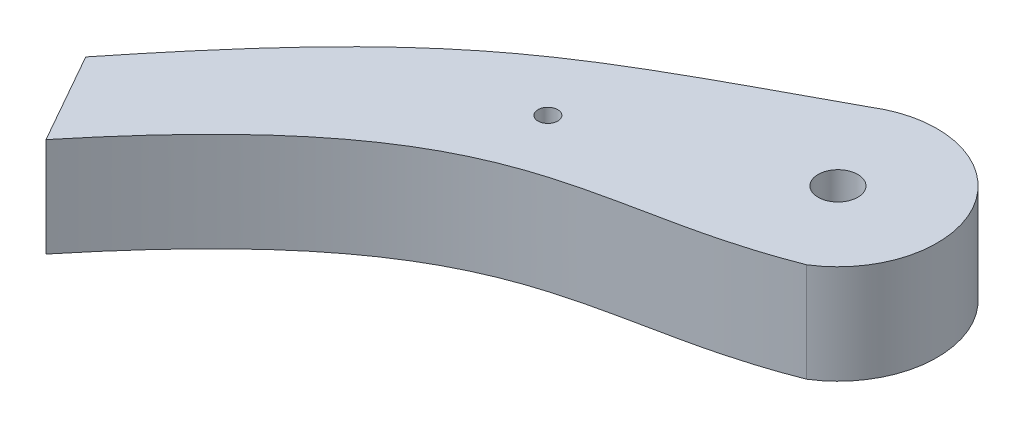
ISO-10303-21;
HEADER;
FILE_DESCRIPTION(('STEP AP214'),'2;1');
FILE_NAME('part.step','',(''),(''),'','','');
FILE_SCHEMA(('AUTOMOTIVE_DESIGN { 1 0 10303 214 1 1 1 1 }'));
ENDSEC;
DATA;
#1=APPLICATION_CONTEXT('core data for automotive mechanical design processes');
#2=APPLICATION_PROTOCOL_DEFINITION('international standard','automotive_design',2000,#1);
#3=PRODUCT_CONTEXT('',#1,'mechanical');
#4=PRODUCT('Part','Part','',(#3));
#5=PRODUCT_RELATED_PRODUCT_CATEGORY('part','',(#4));
#6=PRODUCT_DEFINITION_FORMATION('','',#4);
#7=PRODUCT_DEFINITION_CONTEXT('part definition',#1,'design');
#8=PRODUCT_DEFINITION('design','',#6,#7);
#9=PRODUCT_DEFINITION_SHAPE('','',#8);
#10=(LENGTH_UNIT() NAMED_UNIT(*) SI_UNIT(.MILLI.,.METRE.));
#11=(NAMED_UNIT(*) PLANE_ANGLE_UNIT() SI_UNIT($,.RADIAN.));
#12=(NAMED_UNIT(*) SI_UNIT($,.STERADIAN.) SOLID_ANGLE_UNIT());
#13=UNCERTAINTY_MEASURE_WITH_UNIT(LENGTH_MEASURE(1.E-05),#10,'distance_accuracy_value','');
#14=(GEOMETRIC_REPRESENTATION_CONTEXT(3) GLOBAL_UNCERTAINTY_ASSIGNED_CONTEXT((#13)) GLOBAL_UNIT_ASSIGNED_CONTEXT((#10,
#11,#12)) REPRESENTATION_CONTEXT('',''));
#15=CARTESIAN_POINT('',(0.,0.,0.));
#16=DIRECTION('',(0.,0.,1.));
#17=DIRECTION('',(1.,0.,0.));
#18=AXIS2_PLACEMENT_3D('',#15,#16,#17);
#19=CARTESIAN_POINT('',(-17.529895554147,10.,14.5542905389386));
#20=DIRECTION('',(0.,1.,0.));
#21=DIRECTION('',(0.,0.,1.));
#22=AXIS2_PLACEMENT_3D('',#19,#20,#21);
#23=PLANE('',#22);
#24=CARTESIAN_POINT('',(0.,10.,0.));
#25=DIRECTION('',(0.,1.,0.));
#26=DIRECTION('',(0.,0.,1.));
#27=AXIS2_PLACEMENT_3D('',#24,#25,#26);
#28=CIRCLE('',#27,2.);
#29=CARTESIAN_POINT('',(0.,10.,2.));
#30=VERTEX_POINT('',#29);
#31=EDGE_CURVE('E144',#30,#30,#28,.T.);
#32=ORIENTED_EDGE('',*,*,#31,.F.);
#33=EDGE_LOOP('',(#32));
#34=FACE_BOUND('',#33,.T.);
#35=CARTESIAN_POINT('',(-43.9806813876151,10.,35.9000711908986));
#36=CARTESIAN_POINT('',(-21.8125512290961,10.,8.74021580460605));
#37=CARTESIAN_POINT('',(-12.0456104712389,10.,15.2812172083559));
#38=CARTESIAN_POINT('',(5.31600205544364,10.,8.46995408172435));
#39=B_SPLINE_CURVE_WITH_KNOTS('',3,(#35,#36,#37,#38),.UNSPECIFIED.,.F.,.F.,(4,4),(0.,1.),.UNSPECIFIED.);
#40=CARTESIAN_POINT('',(-43.9806813876151,10.,35.9000711908986));
#41=VERTEX_POINT('',#40);
#42=CARTESIAN_POINT('',(5.31600205544364,10.,8.46995408172435));
#43=VERTEX_POINT('',#42);
#44=EDGE_CURVE('E86',#41,#43,#39,.T.);
#45=ORIENTED_EDGE('',*,*,#44,.T.);
#46=CARTESIAN_POINT('',(0.,10.,0.));
#47=DIRECTION('',(0.,1.,0.));
#48=DIRECTION('',(0.,0.,1.));
#49=AXIS2_PLACEMENT_3D('',#46,#47,#48);
#50=CIRCLE('',#49,10.);
#51=CARTESIAN_POINT('',(-5.31600205544364,10.,-8.46995408172435));
#52=VERTEX_POINT('',#51);
#53=EDGE_CURVE('E81',#43,#52,#50,.T.);
#54=ORIENTED_EDGE('',*,*,#53,.T.);
#55=CARTESIAN_POINT('',(-5.31600205544356,10.,-8.46995408172439));
#56=CARTESIAN_POINT('',(-24.9666647630697,10.,2.13955382037074));
#57=CARTESIAN_POINT('',(-31.8452813342878,10.,4.90051761286262));
#58=CARTESIAN_POINT('',(-49.1990291436304,10.,26.6735927837232));
#59=B_SPLINE_CURVE_WITH_KNOTS('',3,(#55,#56,#57,#58),.UNSPECIFIED.,.F.,.F.,(4,4),(0.,1.),.UNSPECIFIED.);
#60=CARTESIAN_POINT('',(-49.1990291436304,10.,26.6735927837232));
#61=VERTEX_POINT('',#60);
#62=EDGE_CURVE('E84',#52,#61,#59,.T.);
#63=ORIENTED_EDGE('',*,*,#62,.T.);
#64=DIRECTION('',(0.492299023748937,0.,0.870426143458389));
#65=VECTOR('',#64,1.);
#66=CARTESIAN_POINT('',(-43.9806813876151,10.,35.9000711908986));
#67=LINE('',#66,#65);
#68=EDGE_CURVE('E51',#61,#41,#67,.T.);
#69=ORIENTED_EDGE('',*,*,#68,.T.);
#70=EDGE_LOOP('',(#45,#54,#63,#69));
#71=FACE_BOUND('',#70,.T.);
#72=CARTESIAN_POINT('',(-20.7887445373771,10.,8.46995408172435));
#73=DIRECTION('',(0.,1.,0.));
#74=DIRECTION('',(0.,0.,1.));
#75=AXIS2_PLACEMENT_3D('',#72,#73,#74);
#76=CIRCLE('',#75,1.);
#77=CARTESIAN_POINT('',(-20.7887445373771,10.,9.46995408172435));
#78=VERTEX_POINT('',#77);
#79=EDGE_CURVE('E135',#78,#78,#76,.T.);
#80=ORIENTED_EDGE('',*,*,#79,.F.);
#81=EDGE_LOOP('',(#80));
#82=FACE_BOUND('',#81,.T.);
#83=ADVANCED_FACE('F33',(#34,#71,#82),#23,.T.);
#84=CARTESIAN_POINT('',(-17.529895554147,0.,14.5542905389386));
#85=DIRECTION('',(0.,1.,0.));
#86=DIRECTION('',(0.,0.,1.));
#87=AXIS2_PLACEMENT_3D('',#84,#85,#86);
#88=PLANE('',#87);
#89=CARTESIAN_POINT('',(0.,0.,0.));
#90=DIRECTION('',(0.,1.,0.));
#91=DIRECTION('',(0.,0.,1.));
#92=AXIS2_PLACEMENT_3D('',#89,#90,#91);
#93=CIRCLE('',#92,2.);
#94=CARTESIAN_POINT('',(0.,0.,2.));
#95=VERTEX_POINT('',#94);
#96=EDGE_CURVE('E141',#95,#95,#93,.T.);
#97=ORIENTED_EDGE('',*,*,#96,.T.);
#98=EDGE_LOOP('',(#97));
#99=FACE_BOUND('',#98,.T.);
#100=CARTESIAN_POINT('',(-43.9806813876151,0.,35.9000711908986));
#101=CARTESIAN_POINT('',(-21.8125512290961,0.,8.74021580460605));
#102=CARTESIAN_POINT('',(-12.0456104712389,0.,15.2812172083559));
#103=CARTESIAN_POINT('',(5.31600205544364,0.,8.46995408172435));
#104=B_SPLINE_CURVE_WITH_KNOTS('',3,(#100,#101,#102,#103),.UNSPECIFIED.,.F.,.F.,(4,4),(0.,1.),.UNSPECIFIED.);
#105=CARTESIAN_POINT('',(-43.9806813876151,0.,35.9000711908986));
#106=VERTEX_POINT('',#105);
#107=CARTESIAN_POINT('',(5.31600205544364,0.,8.46995408172435));
#108=VERTEX_POINT('',#107);
#109=EDGE_CURVE('E147',#106,#108,#104,.T.);
#110=ORIENTED_EDGE('',*,*,#109,.F.);
#111=DIRECTION('',(0.492299023748937,0.,0.870426143458389));
#112=VECTOR('',#111,1.);
#113=CARTESIAN_POINT('',(-43.9806813876151,0.,35.9000711908986));
#114=LINE('',#113,#112);
#115=CARTESIAN_POINT('',(-49.1990291436304,0.,26.6735927837232));
#116=VERTEX_POINT('',#115);
#117=EDGE_CURVE('E74',#116,#106,#114,.T.);
#118=ORIENTED_EDGE('',*,*,#117,.F.);
#119=CARTESIAN_POINT('',(-5.31600205544356,0.,-8.46995408172439));
#120=CARTESIAN_POINT('',(-24.9666647630697,0.,2.13955382037074));
#121=CARTESIAN_POINT('',(-31.8452813342878,0.,4.90051761286262));
#122=CARTESIAN_POINT('',(-49.1990291436304,0.,26.6735927837232));
#123=B_SPLINE_CURVE_WITH_KNOTS('',3,(#119,#120,#121,#122),.UNSPECIFIED.,.F.,.F.,(4,4),(0.,1.),.UNSPECIFIED.);
#124=CARTESIAN_POINT('',(-5.31600205544364,0.,-8.46995408172435));
#125=VERTEX_POINT('',#124);
#126=EDGE_CURVE('E68',#125,#116,#123,.T.);
#127=ORIENTED_EDGE('',*,*,#126,.F.);
#128=CARTESIAN_POINT('',(0.,0.,0.));
#129=DIRECTION('',(0.,1.,0.));
#130=DIRECTION('',(0.,0.,1.));
#131=AXIS2_PLACEMENT_3D('',#128,#129,#130);
#132=CIRCLE('',#131,10.);
#133=EDGE_CURVE('E90',#108,#125,#132,.T.);
#134=ORIENTED_EDGE('',*,*,#133,.F.);
#135=EDGE_LOOP('',(#110,#118,#127,#134));
#136=FACE_BOUND('',#135,.T.);
#137=CARTESIAN_POINT('',(-20.7887445373771,0.,8.46995408172435));
#138=DIRECTION('',(0.,1.,0.));
#139=DIRECTION('',(0.,0.,1.));
#140=AXIS2_PLACEMENT_3D('',#137,#138,#139);
#141=CIRCLE('',#140,1.);
#142=CARTESIAN_POINT('',(-20.7887445373771,0.,9.46995408172435));
#143=VERTEX_POINT('',#142);
#144=EDGE_CURVE('E138',#143,#143,#141,.T.);
#145=ORIENTED_EDGE('',*,*,#144,.T.);
#146=EDGE_LOOP('',(#145));
#147=FACE_BOUND('',#146,.T.);
#148=ADVANCED_FACE('F112',(#99,#136,#147),#88,.F.);
#149=DIRECTION('',(0.,-1.,0.));
#150=VECTOR('',#149,1.);
#151=SURFACE_OF_LINEAR_EXTRUSION('',#39,#150);
#152=ORIENTED_EDGE('',*,*,#109,.T.);
#153=DIRECTION('',(0.,-1.,0.));
#154=VECTOR('',#153,1.);
#155=CARTESIAN_POINT('',(5.31600205544364,10.,8.46995408172435));
#156=LINE('',#155,#154);
#157=EDGE_CURVE('E11',#43,#108,#156,.T.);
#158=ORIENTED_EDGE('',*,*,#157,.F.);
#159=ORIENTED_EDGE('',*,*,#44,.F.);
#160=DIRECTION('',(0.,-1.,0.));
#161=VECTOR('',#160,1.);
#162=CARTESIAN_POINT('',(-43.9806813876151,10.,35.9000711908986));
#163=LINE('',#162,#161);
#164=EDGE_CURVE('E94',#41,#106,#163,.T.);
#165=ORIENTED_EDGE('',*,*,#164,.T.);
#166=EDGE_LOOP('',(#152,#158,#159,#165));
#167=FACE_BOUND('',#166,.T.);
#168=ADVANCED_FACE('F35',(#167),#151,.F.);
#169=CARTESIAN_POINT('',(0.,10.,0.));
#170=DIRECTION('',(0.,-1.,0.));
#171=DIRECTION('',(0.,0.,-1.));
#172=AXIS2_PLACEMENT_3D('',#169,#170,#171);
#173=CYLINDRICAL_SURFACE('',#172,10.);
#174=ORIENTED_EDGE('',*,*,#133,.T.);
#175=DIRECTION('',(0.,-1.,0.));
#176=VECTOR('',#175,1.);
#177=CARTESIAN_POINT('',(-5.31600205544364,10.,-8.46995408172435));
#178=LINE('',#177,#176);
#179=EDGE_CURVE('E43',#52,#125,#178,.T.);
#180=ORIENTED_EDGE('',*,*,#179,.F.);
#181=ORIENTED_EDGE('',*,*,#53,.F.);
#182=ORIENTED_EDGE('',*,*,#157,.T.);
#183=EDGE_LOOP('',(#174,#180,#181,#182));
#184=FACE_BOUND('',#183,.T.);
#185=ADVANCED_FACE('F89',(#184),#173,.T.);
#186=DIRECTION('',(0.,-1.,0.));
#187=VECTOR('',#186,1.);
#188=SURFACE_OF_LINEAR_EXTRUSION('',#59,#187);
#189=ORIENTED_EDGE('',*,*,#126,.T.);
#190=DIRECTION('',(0.,-1.,0.));
#191=VECTOR('',#190,1.);
#192=CARTESIAN_POINT('',(-49.1990291436304,10.,26.6735927837232));
#193=LINE('',#192,#191);
#194=EDGE_CURVE('E91',#61,#116,#193,.T.);
#195=ORIENTED_EDGE('',*,*,#194,.F.);
#196=ORIENTED_EDGE('',*,*,#62,.F.);
#197=ORIENTED_EDGE('',*,*,#179,.T.);
#198=EDGE_LOOP('',(#189,#195,#196,#197));
#199=FACE_BOUND('',#198,.T.);
#200=ADVANCED_FACE('F92',(#199),#188,.F.);
#201=CARTESIAN_POINT('',(-43.9806813876151,10.,35.9000711908986));
#202=DIRECTION('',(0.870426143458389,0.,-0.492299023748937));
#203=DIRECTION('',(-0.492299023748937,0.,-0.870426143458389));
#204=AXIS2_PLACEMENT_3D('',#201,#202,#203);
#205=PLANE('',#204);
#206=ORIENTED_EDGE('',*,*,#117,.T.);
#207=ORIENTED_EDGE('',*,*,#164,.F.);
#208=ORIENTED_EDGE('',*,*,#68,.F.);
#209=ORIENTED_EDGE('',*,*,#194,.T.);
#210=EDGE_LOOP('',(#206,#207,#208,#209));
#211=FACE_BOUND('',#210,.T.);
#212=ADVANCED_FACE('F106',(#211),#205,.F.);
#213=CARTESIAN_POINT('',(0.,10.,0.));
#214=DIRECTION('',(0.,-1.,0.));
#215=DIRECTION('',(0.,0.,-1.));
#216=AXIS2_PLACEMENT_3D('',#213,#214,#215);
#217=CYLINDRICAL_SURFACE('',#216,2.);
#218=ORIENTED_EDGE('',*,*,#31,.T.);
#219=EDGE_LOOP('',(#218));
#220=FACE_BOUND('',#219,.T.);
#221=ORIENTED_EDGE('',*,*,#96,.F.);
#222=EDGE_LOOP('',(#221));
#223=FACE_BOUND('',#222,.T.);
#224=ADVANCED_FACE('F123',(#220,#223),#217,.F.);
#225=CARTESIAN_POINT('',(-20.7887445373771,10.,8.46995408172435));
#226=DIRECTION('',(0.,-1.,0.));
#227=DIRECTION('',(0.,0.,-1.));
#228=AXIS2_PLACEMENT_3D('',#225,#226,#227);
#229=CYLINDRICAL_SURFACE('',#228,1.);
#230=ORIENTED_EDGE('',*,*,#79,.T.);
#231=EDGE_LOOP('',(#230));
#232=FACE_BOUND('',#231,.T.);
#233=ORIENTED_EDGE('',*,*,#144,.F.);
#234=EDGE_LOOP('',(#233));
#235=FACE_BOUND('',#234,.T.);
#236=ADVANCED_FACE('F126',(#232,#235),#229,.F.);
#237=CLOSED_SHELL('',(#83,#148,#168,#185,#200,#212,#224,#236));
#238=MANIFOLD_SOLID_BREP('B2',#237);
#239=ADVANCED_BREP_SHAPE_REPRESENTATION('',(#18,#238),#14);
#240=SHAPE_DEFINITION_REPRESENTATION(#9,#239);
ENDSEC;
END-ISO-10303-21;
